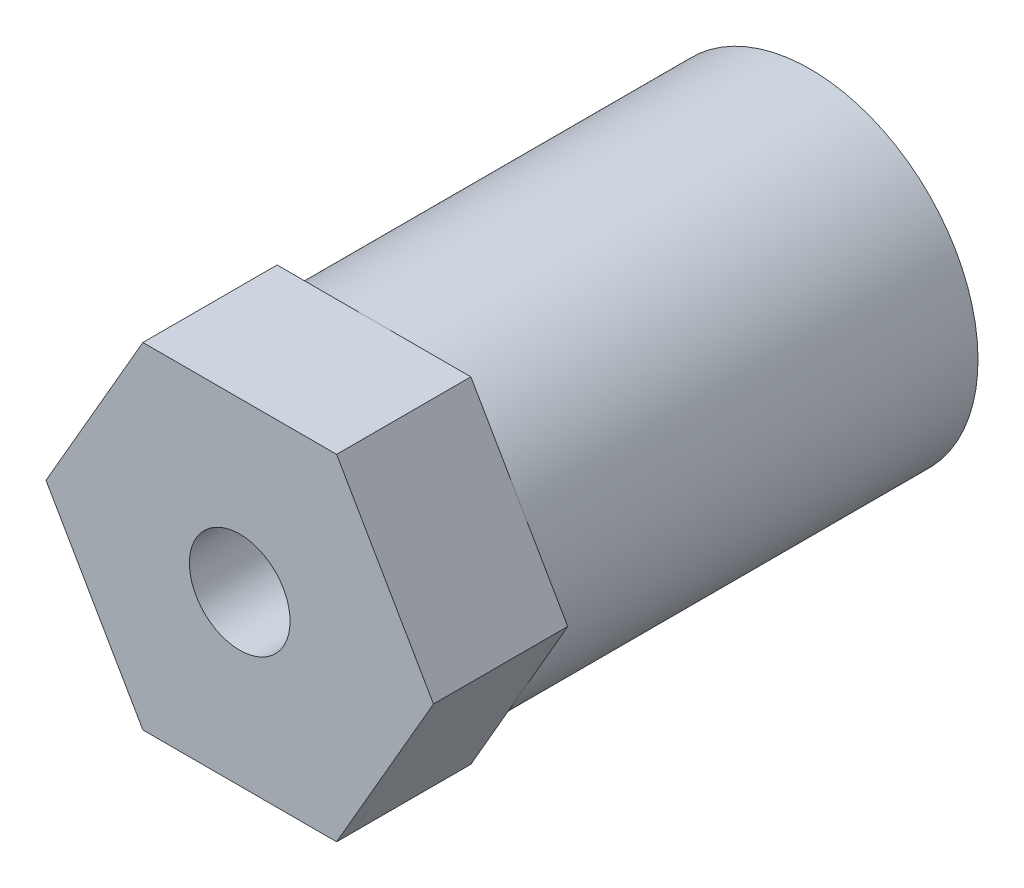
ISO-10303-21;
HEADER;
FILE_DESCRIPTION(('STEP AP214'),'2;1');
FILE_NAME('part.step','',(''),(''),'','','');
FILE_SCHEMA(('AUTOMOTIVE_DESIGN { 1 0 10303 214 1 1 1 1 }'));
ENDSEC;
DATA;
#1=APPLICATION_CONTEXT('core data for automotive mechanical design processes');
#2=APPLICATION_PROTOCOL_DEFINITION('international standard','automotive_design',2000,#1);
#3=PRODUCT_CONTEXT('',#1,'mechanical');
#4=PRODUCT('Part','Part','',(#3));
#5=PRODUCT_RELATED_PRODUCT_CATEGORY('part','',(#4));
#6=PRODUCT_DEFINITION_FORMATION('','',#4);
#7=PRODUCT_DEFINITION_CONTEXT('part definition',#1,'design');
#8=PRODUCT_DEFINITION('design','',#6,#7);
#9=PRODUCT_DEFINITION_SHAPE('','',#8);
#10=(LENGTH_UNIT() NAMED_UNIT(*) SI_UNIT(.MILLI.,.METRE.));
#11=(NAMED_UNIT(*) PLANE_ANGLE_UNIT() SI_UNIT($,.RADIAN.));
#12=(NAMED_UNIT(*) SI_UNIT($,.STERADIAN.) SOLID_ANGLE_UNIT());
#13=UNCERTAINTY_MEASURE_WITH_UNIT(LENGTH_MEASURE(1.E-05),#10,'distance_accuracy_value','');
#14=(GEOMETRIC_REPRESENTATION_CONTEXT(3) GLOBAL_UNCERTAINTY_ASSIGNED_CONTEXT((#13)) GLOBAL_UNIT_ASSIGNED_CONTEXT((#10,
#11,#12)) REPRESENTATION_CONTEXT('',''));
#15=CARTESIAN_POINT('',(0.,0.,0.));
#16=DIRECTION('',(0.,0.,1.));
#17=DIRECTION('',(1.,0.,0.));
#18=AXIS2_PLACEMENT_3D('',#15,#16,#17);
#19=CARTESIAN_POINT('',(0.,0.,0.));
#20=DIRECTION('',(0.,0.,1.));
#21=DIRECTION('',(1.,0.,0.));
#22=AXIS2_PLACEMENT_3D('',#19,#20,#21);
#23=PLANE('',#22);
#24=CARTESIAN_POINT('',(0.,0.,0.));
#25=DIRECTION('',(0.,0.,-1.));
#26=DIRECTION('',(-1.,0.,0.));
#27=AXIS2_PLACEMENT_3D('',#24,#25,#26);
#28=CIRCLE('',#27,5.);
#29=CARTESIAN_POINT('',(-4.33012701892219,2.5,0.));
#30=VERTEX_POINT('',#29);
#31=CARTESIAN_POINT('',(0.,5.,0.));
#32=VERTEX_POINT('',#31);
#33=EDGE_CURVE('E57',#30,#32,#28,.T.);
#34=ORIENTED_EDGE('',*,*,#33,.F.);
#35=DIRECTION('',(-0.5,-0.866025403784439,0.));
#36=VECTOR('',#35,1.);
#37=CARTESIAN_POINT('',(-2.88675134594813,5.,0.));
#38=LINE('',#37,#36);
#39=CARTESIAN_POINT('',(-2.88675134594813,5.,0.));
#40=VERTEX_POINT('',#39);
#41=EDGE_CURVE('E122',#40,#30,#38,.T.);
#42=ORIENTED_EDGE('',*,*,#41,.F.);
#43=DIRECTION('',(-1.,0.,0.));
#44=VECTOR('',#43,1.);
#45=CARTESIAN_POINT('',(2.88675134594813,5.,0.));
#46=LINE('',#45,#44);
#47=EDGE_CURVE('E141',#32,#40,#46,.T.);
#48=ORIENTED_EDGE('',*,*,#47,.F.);
#49=EDGE_LOOP('',(#34,#42,#48));
#50=FACE_BOUND('',#49,.T.);
#51=ADVANCED_FACE('F45',(#50),#23,.F.);
#52=CARTESIAN_POINT('',(4.3301270189222,2.5,0.));
#53=VERTEX_POINT('',#52);
#54=EDGE_CURVE('E12',#32,#53,#28,.T.);
#55=ORIENTED_EDGE('',*,*,#54,.F.);
#56=CARTESIAN_POINT('',(2.88675134594813,5.,0.));
#57=VERTEX_POINT('',#56);
#58=EDGE_CURVE('E139',#57,#32,#46,.T.);
#59=ORIENTED_EDGE('',*,*,#58,.F.);
#60=DIRECTION('',(-0.5,0.866025403784439,0.));
#61=VECTOR('',#60,1.);
#62=CARTESIAN_POINT('',(5.77350269189626,0.,0.));
#63=LINE('',#62,#61);
#64=EDGE_CURVE('E163',#53,#57,#63,.T.);
#65=ORIENTED_EDGE('',*,*,#64,.F.);
#66=EDGE_LOOP('',(#55,#59,#65));
#67=FACE_BOUND('',#66,.T.);
#68=ADVANCED_FACE('F249',(#67),#23,.F.);
#69=CARTESIAN_POINT('',(4.3301270189222,-2.5,0.));
#70=VERTEX_POINT('',#69);
#71=EDGE_CURVE('E55',#53,#70,#28,.T.);
#72=ORIENTED_EDGE('',*,*,#71,.F.);
#73=CARTESIAN_POINT('',(5.77350269189626,0.,0.));
#74=VERTEX_POINT('',#73);
#75=EDGE_CURVE('E189',#74,#53,#63,.T.);
#76=ORIENTED_EDGE('',*,*,#75,.F.);
#77=DIRECTION('',(0.5,0.866025403784439,0.));
#78=VECTOR('',#77,1.);
#79=CARTESIAN_POINT('',(2.88675134594813,-5.,0.));
#80=LINE('',#79,#78);
#81=EDGE_CURVE('E202',#70,#74,#80,.T.);
#82=ORIENTED_EDGE('',*,*,#81,.F.);
#83=EDGE_LOOP('',(#72,#76,#82));
#84=FACE_BOUND('',#83,.T.);
#85=ADVANCED_FACE('F254',(#84),#23,.F.);
#86=CARTESIAN_POINT('',(0.,-5.,0.));
#87=VERTEX_POINT('',#86);
#88=EDGE_CURVE('E154',#70,#87,#28,.T.);
#89=ORIENTED_EDGE('',*,*,#88,.F.);
#90=CARTESIAN_POINT('',(2.88675134594813,-5.,0.));
#91=VERTEX_POINT('',#90);
#92=EDGE_CURVE('E173',#91,#70,#80,.T.);
#93=ORIENTED_EDGE('',*,*,#92,.F.);
#94=DIRECTION('',(1.,0.,0.));
#95=VECTOR('',#94,1.);
#96=CARTESIAN_POINT('',(-2.88675134594812,-5.,0.));
#97=LINE('',#96,#95);
#98=EDGE_CURVE('E197',#87,#91,#97,.T.);
#99=ORIENTED_EDGE('',*,*,#98,.F.);
#100=EDGE_LOOP('',(#89,#93,#99));
#101=FACE_BOUND('',#100,.T.);
#102=ADVANCED_FACE('F272',(#101),#23,.F.);
#103=CARTESIAN_POINT('',(-4.33012701892219,-2.5,0.));
#104=VERTEX_POINT('',#103);
#105=EDGE_CURVE('E150',#87,#104,#28,.T.);
#106=ORIENTED_EDGE('',*,*,#105,.F.);
#107=CARTESIAN_POINT('',(-2.88675134594812,-5.,0.));
#108=VERTEX_POINT('',#107);
#109=EDGE_CURVE('E198',#108,#87,#97,.T.);
#110=ORIENTED_EDGE('',*,*,#109,.F.);
#111=DIRECTION('',(0.5,-0.866025403784438,0.));
#112=VECTOR('',#111,1.);
#113=CARTESIAN_POINT('',(-5.77350269189626,0.,0.));
#114=LINE('',#113,#112);
#115=EDGE_CURVE('E133',#104,#108,#114,.T.);
#116=ORIENTED_EDGE('',*,*,#115,.F.);
#117=EDGE_LOOP('',(#106,#110,#116));
#118=FACE_BOUND('',#117,.T.);
#119=ADVANCED_FACE('F267',(#118),#23,.F.);
#120=CARTESIAN_POINT('',(0.,0.,0.));
#121=DIRECTION('',(0.,0.,1.));
#122=DIRECTION('',(1.,0.,0.));
#123=AXIS2_PLACEMENT_3D('',#120,#121,#122);
#124=CIRCLE('',#123,1.5);
#125=CARTESIAN_POINT('',(1.5,0.,0.));
#126=VERTEX_POINT('',#125);
#127=EDGE_CURVE('E164',#126,#126,#124,.T.);
#128=ORIENTED_EDGE('',*,*,#127,.T.);
#129=EDGE_LOOP('',(#128));
#130=FACE_BOUND('',#129,.T.);
#131=CARTESIAN_POINT('',(0.,0.,0.));
#132=DIRECTION('',(0.,0.,-1.));
#133=DIRECTION('',(-1.,0.,0.));
#134=AXIS2_PLACEMENT_3D('',#131,#132,#133);
#135=CIRCLE('',#134,2.5);
#136=CARTESIAN_POINT('',(-2.5,0.,0.));
#137=VERTEX_POINT('',#136);
#138=EDGE_CURVE('E230',#137,#137,#135,.T.);
#139=ORIENTED_EDGE('',*,*,#138,.T.);
#140=EDGE_LOOP('',(#139));
#141=FACE_BOUND('',#140,.T.);
#142=ADVANCED_FACE('F235',(#130,#141),#23,.F.);
#143=CARTESIAN_POINT('',(0.,0.,4.));
#144=DIRECTION('',(0.,0.,1.));
#145=DIRECTION('',(1.,0.,0.));
#146=AXIS2_PLACEMENT_3D('',#143,#144,#145);
#147=PLANE('',#146);
#148=DIRECTION('',(-0.5,0.866025403784439,0.));
#149=VECTOR('',#148,1.);
#150=CARTESIAN_POINT('',(5.77350269189626,0.,4.));
#151=LINE('',#150,#149);
#152=CARTESIAN_POINT('',(5.77350269189626,0.,4.));
#153=VERTEX_POINT('',#152);
#154=CARTESIAN_POINT('',(2.88675134594813,5.,4.));
#155=VERTEX_POINT('',#154);
#156=EDGE_CURVE('E168',#153,#155,#151,.T.);
#157=ORIENTED_EDGE('',*,*,#156,.T.);
#158=DIRECTION('',(-1.,0.,0.));
#159=VECTOR('',#158,1.);
#160=CARTESIAN_POINT('',(2.88675134594813,5.,4.));
#161=LINE('',#160,#159);
#162=CARTESIAN_POINT('',(-2.88675134594813,5.,4.));
#163=VERTEX_POINT('',#162);
#164=EDGE_CURVE('E172',#155,#163,#161,.T.);
#165=ORIENTED_EDGE('',*,*,#164,.T.);
#166=DIRECTION('',(-0.5,-0.866025403784439,0.));
#167=VECTOR('',#166,1.);
#168=CARTESIAN_POINT('',(-2.88675134594813,5.,4.));
#169=LINE('',#168,#167);
#170=CARTESIAN_POINT('',(-5.77350269189626,0.,4.));
#171=VERTEX_POINT('',#170);
#172=EDGE_CURVE('E176',#163,#171,#169,.T.);
#173=ORIENTED_EDGE('',*,*,#172,.T.);
#174=DIRECTION('',(0.5,-0.866025403784438,0.));
#175=VECTOR('',#174,1.);
#176=CARTESIAN_POINT('',(-5.77350269189626,0.,4.));
#177=LINE('',#176,#175);
#178=CARTESIAN_POINT('',(-2.88675134594812,-5.,4.));
#179=VERTEX_POINT('',#178);
#180=EDGE_CURVE('E179',#171,#179,#177,.T.);
#181=ORIENTED_EDGE('',*,*,#180,.T.);
#182=DIRECTION('',(1.,0.,0.));
#183=VECTOR('',#182,1.);
#184=CARTESIAN_POINT('',(-2.88675134594812,-5.,4.));
#185=LINE('',#184,#183);
#186=CARTESIAN_POINT('',(2.88675134594813,-5.,4.));
#187=VERTEX_POINT('',#186);
#188=EDGE_CURVE('E182',#179,#187,#185,.T.);
#189=ORIENTED_EDGE('',*,*,#188,.T.);
#190=DIRECTION('',(0.5,0.866025403784439,0.));
#191=VECTOR('',#190,1.);
#192=CARTESIAN_POINT('',(2.88675134594813,-5.,4.));
#193=LINE('',#192,#191);
#194=EDGE_CURVE('E185',#187,#153,#193,.T.);
#195=ORIENTED_EDGE('',*,*,#194,.T.);
#196=EDGE_LOOP('',(#157,#165,#173,#181,#189,#195));
#197=FACE_BOUND('',#196,.T.);
#198=CARTESIAN_POINT('',(0.,0.,4.));
#199=DIRECTION('',(0.,0.,1.));
#200=DIRECTION('',(1.,0.,0.));
#201=AXIS2_PLACEMENT_3D('',#198,#199,#200);
#202=CIRCLE('',#201,1.5);
#203=CARTESIAN_POINT('',(1.5,0.,4.));
#204=VERTEX_POINT('',#203);
#205=EDGE_CURVE('E159',#204,#204,#202,.T.);
#206=ORIENTED_EDGE('',*,*,#205,.F.);
#207=EDGE_LOOP('',(#206));
#208=FACE_BOUND('',#207,.T.);
#209=ADVANCED_FACE('F258',(#197,#208),#147,.T.);
#210=EDGE_CURVE('E70',#104,#30,#28,.T.);
#211=ORIENTED_EDGE('',*,*,#210,.F.);
#212=CARTESIAN_POINT('',(-5.77350269189626,0.,0.));
#213=VERTEX_POINT('',#212);
#214=EDGE_CURVE('E137',#213,#104,#114,.T.);
#215=ORIENTED_EDGE('',*,*,#214,.F.);
#216=EDGE_CURVE('E125',#30,#213,#38,.T.);
#217=ORIENTED_EDGE('',*,*,#216,.F.);
#218=EDGE_LOOP('',(#211,#215,#217));
#219=FACE_BOUND('',#218,.T.);
#220=ADVANCED_FACE('F135',(#219),#23,.F.);
#221=CARTESIAN_POINT('',(5.77350269189626,0.,4.));
#222=DIRECTION('',(-0.866025403784439,-0.5,0.));
#223=DIRECTION('',(0.5,-0.866025403784439,0.));
#224=AXIS2_PLACEMENT_3D('',#221,#222,#223);
#225=PLANE('',#224);
#226=ORIENTED_EDGE('',*,*,#75,.T.);
#227=ORIENTED_EDGE('',*,*,#64,.T.);
#228=DIRECTION('',(0.,0.,-1.));
#229=VECTOR('',#228,1.);
#230=CARTESIAN_POINT('',(2.88675134594813,5.,4.));
#231=LINE('',#230,#229);
#232=EDGE_CURVE('E49',#155,#57,#231,.T.);
#233=ORIENTED_EDGE('',*,*,#232,.F.);
#234=ORIENTED_EDGE('',*,*,#156,.F.);
#235=DIRECTION('',(0.,0.,-1.));
#236=VECTOR('',#235,1.);
#237=CARTESIAN_POINT('',(5.77350269189626,0.,4.));
#238=LINE('',#237,#236);
#239=EDGE_CURVE('E188',#153,#74,#238,.T.);
#240=ORIENTED_EDGE('',*,*,#239,.T.);
#241=EDGE_LOOP('',(#226,#227,#233,#234,#240));
#242=FACE_BOUND('',#241,.T.);
#243=ADVANCED_FACE('F47',(#242),#225,.F.);
#244=CARTESIAN_POINT('',(2.88675134594813,5.,4.));
#245=DIRECTION('',(0.,-1.,0.));
#246=DIRECTION('',(1.,0.,0.));
#247=AXIS2_PLACEMENT_3D('',#244,#245,#246);
#248=PLANE('',#247);
#249=ORIENTED_EDGE('',*,*,#58,.T.);
#250=ORIENTED_EDGE('',*,*,#47,.T.);
#251=DIRECTION('',(0.,0.,-1.));
#252=VECTOR('',#251,1.);
#253=CARTESIAN_POINT('',(-2.88675134594813,5.,4.));
#254=LINE('',#253,#252);
#255=EDGE_CURVE('E129',#163,#40,#254,.T.);
#256=ORIENTED_EDGE('',*,*,#255,.F.);
#257=ORIENTED_EDGE('',*,*,#164,.F.);
#258=ORIENTED_EDGE('',*,*,#232,.T.);
#259=EDGE_LOOP('',(#249,#250,#256,#257,#258));
#260=FACE_BOUND('',#259,.T.);
#261=ADVANCED_FACE('F263',(#260),#248,.F.);
#262=CARTESIAN_POINT('',(-2.88675134594813,5.,4.));
#263=DIRECTION('',(0.866025403784439,-0.5,0.));
#264=DIRECTION('',(0.5,0.866025403784439,0.));
#265=AXIS2_PLACEMENT_3D('',#262,#263,#264);
#266=PLANE('',#265);
#267=ORIENTED_EDGE('',*,*,#41,.T.);
#268=ORIENTED_EDGE('',*,*,#216,.T.);
#269=DIRECTION('',(0.,0.,-1.));
#270=VECTOR('',#269,1.);
#271=CARTESIAN_POINT('',(-5.77350269189626,0.,4.));
#272=LINE('',#271,#270);
#273=EDGE_CURVE('E217',#171,#213,#272,.T.);
#274=ORIENTED_EDGE('',*,*,#273,.F.);
#275=ORIENTED_EDGE('',*,*,#172,.F.);
#276=ORIENTED_EDGE('',*,*,#255,.T.);
#277=EDGE_LOOP('',(#267,#268,#274,#275,#276));
#278=FACE_BOUND('',#277,.T.);
#279=ADVANCED_FACE('F123',(#278),#266,.F.);
#280=CARTESIAN_POINT('',(-5.77350269189626,0.,4.));
#281=DIRECTION('',(0.866025403784438,0.5,0.));
#282=DIRECTION('',(-0.5,0.866025403784438,0.));
#283=AXIS2_PLACEMENT_3D('',#280,#281,#282);
#284=PLANE('',#283);
#285=ORIENTED_EDGE('',*,*,#214,.T.);
#286=ORIENTED_EDGE('',*,*,#115,.T.);
#287=DIRECTION('',(0.,0.,-1.));
#288=VECTOR('',#287,1.);
#289=CARTESIAN_POINT('',(-2.88675134594812,-5.,4.));
#290=LINE('',#289,#288);
#291=EDGE_CURVE('E213',#179,#108,#290,.T.);
#292=ORIENTED_EDGE('',*,*,#291,.F.);
#293=ORIENTED_EDGE('',*,*,#180,.F.);
#294=ORIENTED_EDGE('',*,*,#273,.T.);
#295=EDGE_LOOP('',(#285,#286,#292,#293,#294));
#296=FACE_BOUND('',#295,.T.);
#297=ADVANCED_FACE('F293',(#296),#284,.F.);
#298=CARTESIAN_POINT('',(-2.88675134594812,-5.,4.));
#299=DIRECTION('',(0.,1.,0.));
#300=DIRECTION('',(-1.,0.,0.));
#301=AXIS2_PLACEMENT_3D('',#298,#299,#300);
#302=PLANE('',#301);
#303=ORIENTED_EDGE('',*,*,#109,.T.);
#304=ORIENTED_EDGE('',*,*,#98,.T.);
#305=DIRECTION('',(0.,0.,-1.));
#306=VECTOR('',#305,1.);
#307=CARTESIAN_POINT('',(2.88675134594813,-5.,4.));
#308=LINE('',#307,#306);
#309=EDGE_CURVE('E209',#187,#91,#308,.T.);
#310=ORIENTED_EDGE('',*,*,#309,.F.);
#311=ORIENTED_EDGE('',*,*,#188,.F.);
#312=ORIENTED_EDGE('',*,*,#291,.T.);
#313=EDGE_LOOP('',(#303,#304,#310,#311,#312));
#314=FACE_BOUND('',#313,.T.);
#315=ADVANCED_FACE('F286',(#314),#302,.F.);
#316=CARTESIAN_POINT('',(2.88675134594813,-5.,4.));
#317=DIRECTION('',(-0.866025403784439,0.5,0.));
#318=DIRECTION('',(-0.5,-0.866025403784439,0.));
#319=AXIS2_PLACEMENT_3D('',#316,#317,#318);
#320=PLANE('',#319);
#321=ORIENTED_EDGE('',*,*,#92,.T.);
#322=ORIENTED_EDGE('',*,*,#81,.T.);
#323=ORIENTED_EDGE('',*,*,#239,.F.);
#324=ORIENTED_EDGE('',*,*,#194,.F.);
#325=ORIENTED_EDGE('',*,*,#309,.T.);
#326=EDGE_LOOP('',(#321,#322,#323,#324,#325));
#327=FACE_BOUND('',#326,.T.);
#328=ADVANCED_FACE('F278',(#327),#320,.F.);
#329=CARTESIAN_POINT('',(0.,0.,4.));
#330=DIRECTION('',(0.,0.,-1.));
#331=DIRECTION('',(-1.,0.,0.));
#332=AXIS2_PLACEMENT_3D('',#329,#330,#331);
#333=CYLINDRICAL_SURFACE('',#332,1.5);
#334=ORIENTED_EDGE('',*,*,#205,.T.);
#335=EDGE_LOOP('',(#334));
#336=FACE_BOUND('',#335,.T.);
#337=ORIENTED_EDGE('',*,*,#127,.F.);
#338=EDGE_LOOP('',(#337));
#339=FACE_BOUND('',#338,.T.);
#340=ADVANCED_FACE('F276',(#336,#339),#333,.F.);
#341=CARTESIAN_POINT('',(0.,0.,-13.));
#342=DIRECTION('',(0.,0.,-1.));
#343=DIRECTION('',(-1.,0.,0.));
#344=AXIS2_PLACEMENT_3D('',#341,#342,#343);
#345=PLANE('',#344);
#346=CARTESIAN_POINT('',(0.,0.,-13.));
#347=DIRECTION('',(0.,0.,-1.));
#348=DIRECTION('',(-1.,0.,0.));
#349=AXIS2_PLACEMENT_3D('',#346,#347,#348);
#350=CIRCLE('',#349,5.);
#351=CARTESIAN_POINT('',(-5.,0.,-13.));
#352=VERTEX_POINT('',#351);
#353=EDGE_CURVE('E145',#352,#352,#350,.T.);
#354=ORIENTED_EDGE('',*,*,#353,.T.);
#355=EDGE_LOOP('',(#354));
#356=FACE_BOUND('',#355,.T.);
#357=CARTESIAN_POINT('',(0.,0.,-13.));
#358=DIRECTION('',(0.,0.,-1.));
#359=DIRECTION('',(-1.,0.,0.));
#360=AXIS2_PLACEMENT_3D('',#357,#358,#359);
#361=CIRCLE('',#360,2.5);
#362=CARTESIAN_POINT('',(-2.5,0.,-13.));
#363=VERTEX_POINT('',#362);
#364=EDGE_CURVE('E146',#363,#363,#361,.T.);
#365=ORIENTED_EDGE('',*,*,#364,.F.);
#366=EDGE_LOOP('',(#365));
#367=FACE_BOUND('',#366,.T.);
#368=ADVANCED_FACE('F244',(#356,#367),#345,.T.);
#369=CARTESIAN_POINT('',(0.,0.,-13.));
#370=DIRECTION('',(0.,0.,1.));
#371=DIRECTION('',(1.,0.,0.));
#372=AXIS2_PLACEMENT_3D('',#369,#370,#371);
#373=CYLINDRICAL_SURFACE('',#372,5.);
#374=ORIENTED_EDGE('',*,*,#353,.F.);
#375=EDGE_LOOP('',(#374));
#376=FACE_BOUND('',#375,.T.);
#377=ORIENTED_EDGE('',*,*,#33,.T.);
#378=ORIENTED_EDGE('',*,*,#54,.T.);
#379=ORIENTED_EDGE('',*,*,#71,.T.);
#380=ORIENTED_EDGE('',*,*,#88,.T.);
#381=ORIENTED_EDGE('',*,*,#105,.T.);
#382=ORIENTED_EDGE('',*,*,#210,.T.);
#383=EDGE_LOOP('',(#377,#378,#379,#380,#381,#382));
#384=FACE_BOUND('',#383,.T.);
#385=ADVANCED_FACE('F148',(#376,#384),#373,.T.);
#386=CARTESIAN_POINT('',(0.,0.,-13.));
#387=DIRECTION('',(0.,0.,1.));
#388=DIRECTION('',(1.,0.,0.));
#389=AXIS2_PLACEMENT_3D('',#386,#387,#388);
#390=CYLINDRICAL_SURFACE('',#389,2.5);
#391=ORIENTED_EDGE('',*,*,#364,.T.);
#392=EDGE_LOOP('',(#391));
#393=FACE_BOUND('',#392,.T.);
#394=ORIENTED_EDGE('',*,*,#138,.F.);
#395=EDGE_LOOP('',(#394));
#396=FACE_BOUND('',#395,.T.);
#397=ADVANCED_FACE('F237',(#393,#396),#390,.F.);
#398=CLOSED_SHELL('',(#51,#68,#85,#102,#119,#142,#209,#220,#243,#261,#279,#297,#315,#328,#340,
#368,#385,#397));
#399=MANIFOLD_SOLID_BREP('B2',#398);
#400=ADVANCED_BREP_SHAPE_REPRESENTATION('',(#18,#399),#14);
#401=SHAPE_DEFINITION_REPRESENTATION(#9,#400);
ENDSEC;
END-ISO-10303-21;
